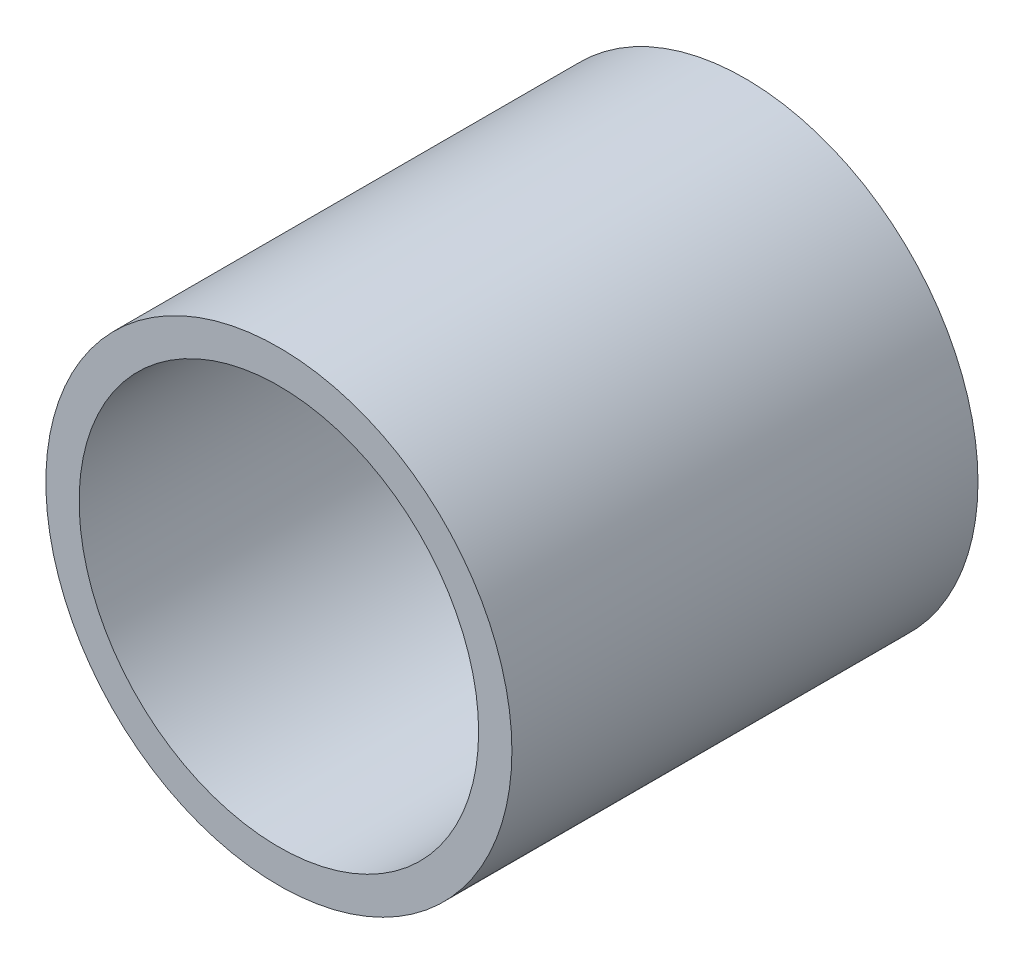
ISO-10303-21;
HEADER;
FILE_DESCRIPTION(('STEP AP214'),'2;1');
FILE_NAME('part.step','',(''),(''),'','','');
FILE_SCHEMA(('AUTOMOTIVE_DESIGN { 1 0 10303 214 1 1 1 1 }'));
ENDSEC;
DATA;
#1=APPLICATION_CONTEXT('core data for automotive mechanical design processes');
#2=APPLICATION_PROTOCOL_DEFINITION('international standard','automotive_design',2000,#1);
#3=PRODUCT_CONTEXT('',#1,'mechanical');
#4=PRODUCT('Part','Part','',(#3));
#5=PRODUCT_RELATED_PRODUCT_CATEGORY('part','',(#4));
#6=PRODUCT_DEFINITION_FORMATION('','',#4);
#7=PRODUCT_DEFINITION_CONTEXT('part definition',#1,'design');
#8=PRODUCT_DEFINITION('design','',#6,#7);
#9=PRODUCT_DEFINITION_SHAPE('','',#8);
#10=(LENGTH_UNIT() NAMED_UNIT(*) SI_UNIT(.MILLI.,.METRE.));
#11=(NAMED_UNIT(*) PLANE_ANGLE_UNIT() SI_UNIT($,.RADIAN.));
#12=(NAMED_UNIT(*) SI_UNIT($,.STERADIAN.) SOLID_ANGLE_UNIT());
#13=UNCERTAINTY_MEASURE_WITH_UNIT(LENGTH_MEASURE(1.E-05),#10,'distance_accuracy_value','');
#14=(GEOMETRIC_REPRESENTATION_CONTEXT(3) GLOBAL_UNCERTAINTY_ASSIGNED_CONTEXT((#13)) GLOBAL_UNIT_ASSIGNED_CONTEXT((#10,
#11,#12)) REPRESENTATION_CONTEXT('',''));
#15=CARTESIAN_POINT('',(0.,0.,0.));
#16=DIRECTION('',(0.,0.,1.));
#17=DIRECTION('',(1.,0.,0.));
#18=AXIS2_PLACEMENT_3D('',#15,#16,#17);
#19=CARTESIAN_POINT('',(0.,0.,14.));
#20=DIRECTION('',(0.,0.,1.));
#21=DIRECTION('',(1.,0.,0.));
#22=AXIS2_PLACEMENT_3D('',#19,#20,#21);
#23=PLANE('',#22);
#24=CARTESIAN_POINT('',(0.,0.,14.));
#25=DIRECTION('',(0.,0.,1.));
#26=DIRECTION('',(1.,0.,0.));
#27=AXIS2_PLACEMENT_3D('',#24,#25,#26);
#28=CIRCLE('',#27,7.);
#29=CARTESIAN_POINT('',(7.,0.,14.));
#30=VERTEX_POINT('',#29);
#31=EDGE_CURVE('E10',#30,#30,#28,.T.);
#32=ORIENTED_EDGE('',*,*,#31,.T.);
#33=EDGE_LOOP('',(#32));
#34=FACE_BOUND('',#33,.T.);
#35=CARTESIAN_POINT('',(0.,0.,14.));
#36=DIRECTION('',(0.,0.,1.));
#37=DIRECTION('',(1.,0.,0.));
#38=AXIS2_PLACEMENT_3D('',#35,#36,#37);
#39=CIRCLE('',#38,6.);
#40=CARTESIAN_POINT('',(6.,0.,14.));
#41=VERTEX_POINT('',#40);
#42=EDGE_CURVE('E50',#41,#41,#39,.T.);
#43=ORIENTED_EDGE('',*,*,#42,.F.);
#44=EDGE_LOOP('',(#43));
#45=FACE_BOUND('',#44,.T.);
#46=ADVANCED_FACE('F37',(#34,#45),#23,.T.);
#47=CARTESIAN_POINT('',(0.,0.,0.));
#48=DIRECTION('',(0.,0.,1.));
#49=DIRECTION('',(1.,0.,0.));
#50=AXIS2_PLACEMENT_3D('',#47,#48,#49);
#51=PLANE('',#50);
#52=CARTESIAN_POINT('',(0.,0.,0.));
#53=DIRECTION('',(0.,0.,1.));
#54=DIRECTION('',(1.,0.,0.));
#55=AXIS2_PLACEMENT_3D('',#52,#53,#54);
#56=CIRCLE('',#55,7.);
#57=CARTESIAN_POINT('',(7.,0.,0.));
#58=VERTEX_POINT('',#57);
#59=EDGE_CURVE('E41',#58,#58,#56,.T.);
#60=ORIENTED_EDGE('',*,*,#59,.F.);
#61=EDGE_LOOP('',(#60));
#62=FACE_BOUND('',#61,.T.);
#63=CARTESIAN_POINT('',(0.,0.,0.));
#64=DIRECTION('',(0.,0.,1.));
#65=DIRECTION('',(1.,0.,0.));
#66=AXIS2_PLACEMENT_3D('',#63,#64,#65);
#67=CIRCLE('',#66,6.);
#68=CARTESIAN_POINT('',(6.,0.,0.));
#69=VERTEX_POINT('',#68);
#70=EDGE_CURVE('E52',#69,#69,#67,.T.);
#71=ORIENTED_EDGE('',*,*,#70,.T.);
#72=EDGE_LOOP('',(#71));
#73=FACE_BOUND('',#72,.T.);
#74=ADVANCED_FACE('F64',(#62,#73),#51,.F.);
#75=CARTESIAN_POINT('',(0.,0.,14.));
#76=DIRECTION('',(0.,0.,-1.));
#77=DIRECTION('',(-1.,0.,0.));
#78=AXIS2_PLACEMENT_3D('',#75,#76,#77);
#79=CYLINDRICAL_SURFACE('',#78,7.);
#80=ORIENTED_EDGE('',*,*,#31,.F.);
#81=EDGE_LOOP('',(#80));
#82=FACE_BOUND('',#81,.T.);
#83=ORIENTED_EDGE('',*,*,#59,.T.);
#84=EDGE_LOOP('',(#83));
#85=FACE_BOUND('',#84,.T.);
#86=ADVANCED_FACE('F39',(#82,#85),#79,.T.);
#87=CARTESIAN_POINT('',(0.,0.,14.));
#88=DIRECTION('',(0.,0.,-1.));
#89=DIRECTION('',(-1.,0.,0.));
#90=AXIS2_PLACEMENT_3D('',#87,#88,#89);
#91=CYLINDRICAL_SURFACE('',#90,6.);
#92=ORIENTED_EDGE('',*,*,#42,.T.);
#93=EDGE_LOOP('',(#92));
#94=FACE_BOUND('',#93,.T.);
#95=ORIENTED_EDGE('',*,*,#70,.F.);
#96=EDGE_LOOP('',(#95));
#97=FACE_BOUND('',#96,.T.);
#98=ADVANCED_FACE('F60',(#94,#97),#91,.F.);
#99=CLOSED_SHELL('',(#46,#74,#86,#98));
#100=MANIFOLD_SOLID_BREP('B2',#99);
#101=ADVANCED_BREP_SHAPE_REPRESENTATION('',(#18,#100),#14);
#102=SHAPE_DEFINITION_REPRESENTATION(#9,#101);
ENDSEC;
END-ISO-10303-21;
